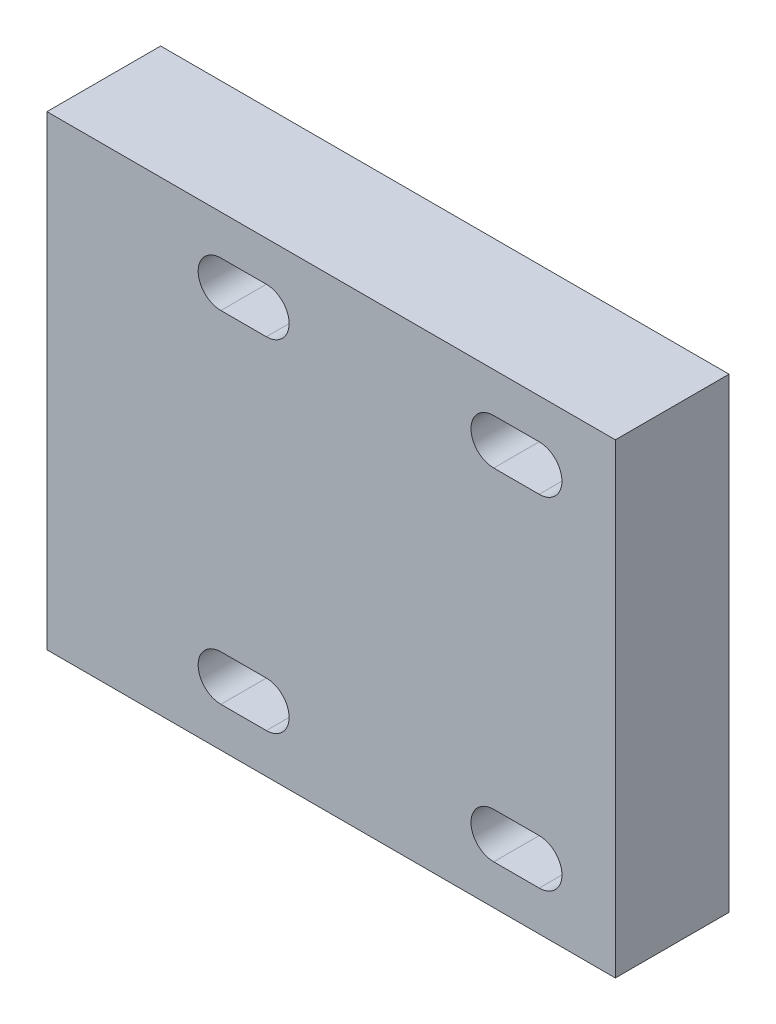
ISO-10303-21;
HEADER;
FILE_DESCRIPTION(('STEP AP214'),'2;1');
FILE_NAME('part.step','',(''),(''),'','','');
FILE_SCHEMA(('AUTOMOTIVE_DESIGN { 1 0 10303 214 1 1 1 1 }'));
ENDSEC;
DATA;
#1=APPLICATION_CONTEXT('core data for automotive mechanical design processes');
#2=APPLICATION_PROTOCOL_DEFINITION('international standard','automotive_design',2000,#1);
#3=PRODUCT_CONTEXT('',#1,'mechanical');
#4=PRODUCT('Part','Part','',(#3));
#5=PRODUCT_RELATED_PRODUCT_CATEGORY('part','',(#4));
#6=PRODUCT_DEFINITION_FORMATION('','',#4);
#7=PRODUCT_DEFINITION_CONTEXT('part definition',#1,'design');
#8=PRODUCT_DEFINITION('design','',#6,#7);
#9=PRODUCT_DEFINITION_SHAPE('','',#8);
#10=(LENGTH_UNIT() NAMED_UNIT(*) SI_UNIT(.MILLI.,.METRE.));
#11=(NAMED_UNIT(*) PLANE_ANGLE_UNIT() SI_UNIT($,.RADIAN.));
#12=(NAMED_UNIT(*) SI_UNIT($,.STERADIAN.) SOLID_ANGLE_UNIT());
#13=UNCERTAINTY_MEASURE_WITH_UNIT(LENGTH_MEASURE(1.E-05),#10,'distance_accuracy_value','');
#14=(GEOMETRIC_REPRESENTATION_CONTEXT(3) GLOBAL_UNCERTAINTY_ASSIGNED_CONTEXT((#13)) GLOBAL_UNIT_ASSIGNED_CONTEXT((#10,
#11,#12)) REPRESENTATION_CONTEXT('',''));
#15=CARTESIAN_POINT('',(0.,0.,0.));
#16=DIRECTION('',(0.,0.,1.));
#17=DIRECTION('',(1.,0.,0.));
#18=AXIS2_PLACEMENT_3D('',#15,#16,#17);
#19=CARTESIAN_POINT('',(-25.,-20.5,-10.));
#20=DIRECTION('',(1.,0.,0.));
#21=DIRECTION('',(0.,0.,1.));
#22=AXIS2_PLACEMENT_3D('',#19,#20,#21);
#23=PLANE('',#22);
#24=DIRECTION('',(0.,-1.,0.));
#25=VECTOR('',#24,1.);
#26=CARTESIAN_POINT('',(-25.,-20.5,0.));
#27=LINE('',#26,#25);
#28=CARTESIAN_POINT('',(-25.,20.5,0.));
#29=VERTEX_POINT('',#28);
#30=CARTESIAN_POINT('',(-25.,-20.5,0.));
#31=VERTEX_POINT('',#30);
#32=EDGE_CURVE('E301',#29,#31,#27,.T.);
#33=ORIENTED_EDGE('',*,*,#32,.F.);
#34=DIRECTION('',(0.,0.,1.));
#35=VECTOR('',#34,1.);
#36=CARTESIAN_POINT('',(-25.,20.5,-10.));
#37=LINE('',#36,#35);
#38=CARTESIAN_POINT('',(-25.,20.5,-10.));
#39=VERTEX_POINT('',#38);
#40=EDGE_CURVE('E319',#39,#29,#37,.T.);
#41=ORIENTED_EDGE('',*,*,#40,.F.);
#42=DIRECTION('',(0.,-1.,0.));
#43=VECTOR('',#42,1.);
#44=CARTESIAN_POINT('',(-25.,-20.5,-10.));
#45=LINE('',#44,#43);
#46=CARTESIAN_POINT('',(-25.,-20.5,-10.));
#47=VERTEX_POINT('',#46);
#48=EDGE_CURVE('E307',#39,#47,#45,.T.);
#49=ORIENTED_EDGE('',*,*,#48,.T.);
#50=DIRECTION('',(0.,0.,1.));
#51=VECTOR('',#50,1.);
#52=CARTESIAN_POINT('',(-25.,-20.5,-10.));
#53=LINE('',#52,#51);
#54=EDGE_CURVE('E11',#47,#31,#53,.T.);
#55=ORIENTED_EDGE('',*,*,#54,.T.);
#56=EDGE_LOOP('',(#33,#41,#49,#55));
#57=FACE_BOUND('',#56,.T.);
#58=ADVANCED_FACE('F35',(#57),#23,.F.);
#59=CARTESIAN_POINT('',(25.,-20.5,-10.));
#60=DIRECTION('',(0.,1.,0.));
#61=DIRECTION('',(-1.,0.,0.));
#62=AXIS2_PLACEMENT_3D('',#59,#60,#61);
#63=PLANE('',#62);
#64=DIRECTION('',(1.,0.,0.));
#65=VECTOR('',#64,1.);
#66=CARTESIAN_POINT('',(25.,-20.5,0.));
#67=LINE('',#66,#65);
#68=CARTESIAN_POINT('',(25.,-20.5,0.));
#69=VERTEX_POINT('',#68);
#70=EDGE_CURVE('E322',#31,#69,#67,.T.);
#71=ORIENTED_EDGE('',*,*,#70,.F.);
#72=ORIENTED_EDGE('',*,*,#54,.F.);
#73=DIRECTION('',(1.,0.,0.));
#74=VECTOR('',#73,1.);
#75=CARTESIAN_POINT('',(25.,-20.5,-10.));
#76=LINE('',#75,#74);
#77=CARTESIAN_POINT('',(25.,-20.5,-10.));
#78=VERTEX_POINT('',#77);
#79=EDGE_CURVE('E310',#47,#78,#76,.T.);
#80=ORIENTED_EDGE('',*,*,#79,.T.);
#81=DIRECTION('',(0.,0.,1.));
#82=VECTOR('',#81,1.);
#83=CARTESIAN_POINT('',(25.,-20.5,-10.));
#84=LINE('',#83,#82);
#85=EDGE_CURVE('E42',#78,#69,#84,.T.);
#86=ORIENTED_EDGE('',*,*,#85,.T.);
#87=EDGE_LOOP('',(#71,#72,#80,#86));
#88=FACE_BOUND('',#87,.T.);
#89=ADVANCED_FACE('F336',(#88),#63,.F.);
#90=CARTESIAN_POINT('',(25.,20.5,-10.));
#91=DIRECTION('',(-1.,0.,0.));
#92=DIRECTION('',(0.,-1.,0.));
#93=AXIS2_PLACEMENT_3D('',#90,#91,#92);
#94=PLANE('',#93);
#95=DIRECTION('',(0.,1.,0.));
#96=VECTOR('',#95,1.);
#97=CARTESIAN_POINT('',(25.,20.5,0.));
#98=LINE('',#97,#96);
#99=CARTESIAN_POINT('',(25.,20.5,0.));
#100=VERTEX_POINT('',#99);
#101=EDGE_CURVE('E325',#69,#100,#98,.T.);
#102=ORIENTED_EDGE('',*,*,#101,.F.);
#103=ORIENTED_EDGE('',*,*,#85,.F.);
#104=DIRECTION('',(0.,1.,0.));
#105=VECTOR('',#104,1.);
#106=CARTESIAN_POINT('',(25.,20.5,-10.));
#107=LINE('',#106,#105);
#108=CARTESIAN_POINT('',(25.,20.5,-10.));
#109=VERTEX_POINT('',#108);
#110=EDGE_CURVE('E314',#78,#109,#107,.T.);
#111=ORIENTED_EDGE('',*,*,#110,.T.);
#112=DIRECTION('',(0.,0.,1.));
#113=VECTOR('',#112,1.);
#114=CARTESIAN_POINT('',(25.,20.5,-10.));
#115=LINE('',#114,#113);
#116=EDGE_CURVE('E331',#109,#100,#115,.T.);
#117=ORIENTED_EDGE('',*,*,#116,.T.);
#118=EDGE_LOOP('',(#102,#103,#111,#117));
#119=FACE_BOUND('',#118,.T.);
#120=ADVANCED_FACE('F347',(#119),#94,.F.);
#121=CARTESIAN_POINT('',(-25.,20.5,-10.));
#122=DIRECTION('',(0.,-1.,0.));
#123=DIRECTION('',(0.,0.,1.));
#124=AXIS2_PLACEMENT_3D('',#121,#122,#123);
#125=PLANE('',#124);
#126=DIRECTION('',(-1.,0.,0.));
#127=VECTOR('',#126,1.);
#128=CARTESIAN_POINT('',(-25.,20.5,0.));
#129=LINE('',#128,#127);
#130=EDGE_CURVE('E311',#100,#29,#129,.T.);
#131=ORIENTED_EDGE('',*,*,#130,.F.);
#132=ORIENTED_EDGE('',*,*,#116,.F.);
#133=DIRECTION('',(-1.,0.,0.));
#134=VECTOR('',#133,1.);
#135=CARTESIAN_POINT('',(-25.,20.5,-10.));
#136=LINE('',#135,#134);
#137=EDGE_CURVE('E317',#109,#39,#136,.T.);
#138=ORIENTED_EDGE('',*,*,#137,.T.);
#139=ORIENTED_EDGE('',*,*,#40,.T.);
#140=EDGE_LOOP('',(#131,#132,#138,#139));
#141=FACE_BOUND('',#140,.T.);
#142=ADVANCED_FACE('F349',(#141),#125,.F.);
#143=CARTESIAN_POINT('',(0.,0.,-10.));
#144=DIRECTION('',(0.,0.,1.));
#145=DIRECTION('',(-1.,0.,0.));
#146=AXIS2_PLACEMENT_3D('',#143,#144,#145);
#147=PLANE('',#146);
#148=DIRECTION('',(-1.,0.,0.));
#149=VECTOR('',#148,1.);
#150=CARTESIAN_POINT('',(18.2999999999988,13.0000000000002,-10.));
#151=LINE('',#150,#149);
#152=CARTESIAN_POINT('',(18.2999999999988,13.0000000000002,-10.));
#153=VERTEX_POINT('',#152);
#154=CARTESIAN_POINT('',(14.2999999999987,13.0000000000002,-10.));
#155=VERTEX_POINT('',#154);
#156=EDGE_CURVE('E225',#153,#155,#151,.T.);
#157=ORIENTED_EDGE('',*,*,#156,.F.);
#158=CARTESIAN_POINT('',(18.2999999999988,15.0000000000002,-10.));
#159=DIRECTION('',(0.,0.,-1.));
#160=DIRECTION('',(-1.,0.,0.));
#161=AXIS2_PLACEMENT_3D('',#158,#159,#160);
#162=CIRCLE('',#161,2.00000000000001);
#163=CARTESIAN_POINT('',(18.2999999999988,17.0000000000002,-10.));
#164=VERTEX_POINT('',#163);
#165=EDGE_CURVE('E223',#164,#153,#162,.T.);
#166=ORIENTED_EDGE('',*,*,#165,.F.);
#167=DIRECTION('',(1.,0.,0.));
#168=VECTOR('',#167,1.);
#169=CARTESIAN_POINT('',(14.2999999999987,17.0000000000002,-10.));
#170=LINE('',#169,#168);
#171=CARTESIAN_POINT('',(14.2999999999987,17.0000000000002,-10.));
#172=VERTEX_POINT('',#171);
#173=EDGE_CURVE('E220',#172,#164,#170,.T.);
#174=ORIENTED_EDGE('',*,*,#173,.F.);
#175=CARTESIAN_POINT('',(14.2999999999987,15.0000000000002,-10.));
#176=DIRECTION('',(0.,0.,-1.));
#177=DIRECTION('',(-1.,0.,0.));
#178=AXIS2_PLACEMENT_3D('',#175,#176,#177);
#179=CIRCLE('',#178,2.00000000000001);
#180=EDGE_CURVE('E217',#155,#172,#179,.T.);
#181=ORIENTED_EDGE('',*,*,#180,.F.);
#182=EDGE_LOOP('',(#157,#166,#174,#181));
#183=FACE_BOUND('',#182,.T.);
#184=DIRECTION('',(1.,0.,0.));
#185=VECTOR('',#184,1.);
#186=CARTESIAN_POINT('',(-5.70000000000125,-13.0000000000002,-10.));
#187=LINE('',#186,#185);
#188=CARTESIAN_POINT('',(-9.70000000000126,-13.0000000000002,-10.));
#189=VERTEX_POINT('',#188);
#190=CARTESIAN_POINT('',(-5.70000000000125,-13.0000000000002,-10.));
#191=VERTEX_POINT('',#190);
#192=EDGE_CURVE('E256',#189,#191,#187,.T.);
#193=ORIENTED_EDGE('',*,*,#192,.F.);
#194=CARTESIAN_POINT('',(-9.70000000000126,-15.0000000000002,-10.));
#195=DIRECTION('',(0.,0.,-1.));
#196=DIRECTION('',(1.,0.,0.));
#197=AXIS2_PLACEMENT_3D('',#194,#195,#196);
#198=CIRCLE('',#197,2.00000000000001);
#199=CARTESIAN_POINT('',(-9.70000000000126,-17.0000000000002,-10.));
#200=VERTEX_POINT('',#199);
#201=EDGE_CURVE('E254',#200,#189,#198,.T.);
#202=ORIENTED_EDGE('',*,*,#201,.F.);
#203=DIRECTION('',(-1.,0.,0.));
#204=VECTOR('',#203,1.);
#205=CARTESIAN_POINT('',(-9.70000000000126,-17.0000000000002,-10.));
#206=LINE('',#205,#204);
#207=CARTESIAN_POINT('',(-5.70000000000125,-17.0000000000002,-10.));
#208=VERTEX_POINT('',#207);
#209=EDGE_CURVE('E251',#208,#200,#206,.T.);
#210=ORIENTED_EDGE('',*,*,#209,.F.);
#211=CARTESIAN_POINT('',(-5.70000000000125,-15.0000000000002,-10.));
#212=DIRECTION('',(0.,0.,-1.));
#213=DIRECTION('',(1.,0.,0.));
#214=AXIS2_PLACEMENT_3D('',#211,#212,#213);
#215=CIRCLE('',#214,2.);
#216=EDGE_CURVE('E248',#191,#208,#215,.T.);
#217=ORIENTED_EDGE('',*,*,#216,.F.);
#218=EDGE_LOOP('',(#193,#202,#210,#217));
#219=FACE_BOUND('',#218,.T.);
#220=DIRECTION('',(1.,0.,0.));
#221=VECTOR('',#220,1.);
#222=CARTESIAN_POINT('',(18.2999999999988,-13.0000000000002,-10.));
#223=LINE('',#222,#221);
#224=CARTESIAN_POINT('',(14.2999999999987,-13.0000000000002,-10.));
#225=VERTEX_POINT('',#224);
#226=CARTESIAN_POINT('',(18.2999999999988,-13.0000000000002,-10.));
#227=VERTEX_POINT('',#226);
#228=EDGE_CURVE('E185',#225,#227,#223,.T.);
#229=ORIENTED_EDGE('',*,*,#228,.F.);
#230=CARTESIAN_POINT('',(14.2999999999987,-15.0000000000002,-10.));
#231=DIRECTION('',(0.,0.,-1.));
#232=DIRECTION('',(1.,0.,0.));
#233=AXIS2_PLACEMENT_3D('',#230,#231,#232);
#234=CIRCLE('',#233,2.00000000000001);
#235=CARTESIAN_POINT('',(14.2999999999987,-17.0000000000002,-10.));
#236=VERTEX_POINT('',#235);
#237=EDGE_CURVE('E199',#236,#225,#234,.T.);
#238=ORIENTED_EDGE('',*,*,#237,.F.);
#239=DIRECTION('',(-1.,0.,0.));
#240=VECTOR('',#239,1.);
#241=CARTESIAN_POINT('',(14.2999999999987,-17.0000000000002,-10.));
#242=LINE('',#241,#240);
#243=CARTESIAN_POINT('',(18.2999999999988,-17.0000000000002,-10.));
#244=VERTEX_POINT('',#243);
#245=EDGE_CURVE('E177',#244,#236,#242,.T.);
#246=ORIENTED_EDGE('',*,*,#245,.F.);
#247=CARTESIAN_POINT('',(18.2999999999988,-15.0000000000002,-10.));
#248=DIRECTION('',(0.,0.,-1.));
#249=DIRECTION('',(1.,0.,0.));
#250=AXIS2_PLACEMENT_3D('',#247,#248,#249);
#251=CIRCLE('',#250,2.00000000000001);
#252=EDGE_CURVE('E188',#227,#244,#251,.T.);
#253=ORIENTED_EDGE('',*,*,#252,.F.);
#254=EDGE_LOOP('',(#229,#238,#246,#253));
#255=FACE_BOUND('',#254,.T.);
#256=DIRECTION('',(1.,0.,0.));
#257=VECTOR('',#256,1.);
#258=CARTESIAN_POINT('',(-9.70000000000126,17.0000000000002,-10.));
#259=LINE('',#258,#257);
#260=CARTESIAN_POINT('',(-9.70000000000126,17.0000000000002,-10.));
#261=VERTEX_POINT('',#260);
#262=CARTESIAN_POINT('',(-5.70000000000125,17.0000000000002,-10.));
#263=VERTEX_POINT('',#262);
#264=EDGE_CURVE('E285',#261,#263,#259,.T.);
#265=ORIENTED_EDGE('',*,*,#264,.F.);
#266=CARTESIAN_POINT('',(-9.70000000000126,15.0000000000002,-10.));
#267=DIRECTION('',(0.,0.,-1.));
#268=DIRECTION('',(-1.,0.,0.));
#269=AXIS2_PLACEMENT_3D('',#266,#267,#268);
#270=CIRCLE('',#269,2.00000000000001);
#271=CARTESIAN_POINT('',(-9.70000000000126,13.0000000000002,-10.));
#272=VERTEX_POINT('',#271);
#273=EDGE_CURVE('E282',#272,#261,#270,.T.);
#274=ORIENTED_EDGE('',*,*,#273,.F.);
#275=DIRECTION('',(-1.,0.,0.));
#276=VECTOR('',#275,1.);
#277=CARTESIAN_POINT('',(-5.70000000000125,13.0000000000002,-10.));
#278=LINE('',#277,#276);
#279=CARTESIAN_POINT('',(-5.70000000000125,13.0000000000002,-10.));
#280=VERTEX_POINT('',#279);
#281=EDGE_CURVE('E278',#280,#272,#278,.T.);
#282=ORIENTED_EDGE('',*,*,#281,.F.);
#283=CARTESIAN_POINT('',(-5.70000000000125,15.0000000000002,-10.));
#284=DIRECTION('',(0.,0.,-1.));
#285=DIRECTION('',(-1.,0.,0.));
#286=AXIS2_PLACEMENT_3D('',#283,#284,#285);
#287=CIRCLE('',#286,2.);
#288=EDGE_CURVE('E275',#263,#280,#287,.T.);
#289=ORIENTED_EDGE('',*,*,#288,.F.);
#290=EDGE_LOOP('',(#265,#274,#282,#289));
#291=FACE_BOUND('',#290,.T.);
#292=ORIENTED_EDGE('',*,*,#48,.F.);
#293=ORIENTED_EDGE('',*,*,#137,.F.);
#294=ORIENTED_EDGE('',*,*,#110,.F.);
#295=ORIENTED_EDGE('',*,*,#79,.F.);
#296=EDGE_LOOP('',(#292,#293,#294,#295));
#297=FACE_BOUND('',#296,.T.);
#298=ADVANCED_FACE('F196',(#183,#219,#255,#291,#297),#147,.F.);
#299=CARTESIAN_POINT('',(0.,0.,0.));
#300=DIRECTION('',(0.,0.,1.));
#301=DIRECTION('',(-1.,0.,0.));
#302=AXIS2_PLACEMENT_3D('',#299,#300,#301);
#303=PLANE('',#302);
#304=CARTESIAN_POINT('',(14.2999999999987,15.0000000000002,0.));
#305=DIRECTION('',(0.,0.,-1.));
#306=DIRECTION('',(-1.,0.,0.));
#307=AXIS2_PLACEMENT_3D('',#304,#305,#306);
#308=CIRCLE('',#307,2.00000000000001);
#309=CARTESIAN_POINT('',(14.2999999999987,13.0000000000002,0.));
#310=VERTEX_POINT('',#309);
#311=CARTESIAN_POINT('',(14.2999999999987,17.0000000000002,0.));
#312=VERTEX_POINT('',#311);
#313=EDGE_CURVE('E229',#310,#312,#308,.T.);
#314=ORIENTED_EDGE('',*,*,#313,.T.);
#315=DIRECTION('',(1.,0.,0.));
#316=VECTOR('',#315,1.);
#317=CARTESIAN_POINT('',(14.2999999999987,17.0000000000002,0.));
#318=LINE('',#317,#316);
#319=CARTESIAN_POINT('',(18.2999999999988,17.0000000000002,0.));
#320=VERTEX_POINT('',#319);
#321=EDGE_CURVE('E232',#312,#320,#318,.T.);
#322=ORIENTED_EDGE('',*,*,#321,.T.);
#323=CARTESIAN_POINT('',(18.2999999999988,15.0000000000002,0.));
#324=DIRECTION('',(0.,0.,-1.));
#325=DIRECTION('',(-1.,0.,0.));
#326=AXIS2_PLACEMENT_3D('',#323,#324,#325);
#327=CIRCLE('',#326,2.00000000000001);
#328=CARTESIAN_POINT('',(18.2999999999988,13.0000000000002,0.));
#329=VERTEX_POINT('',#328);
#330=EDGE_CURVE('E236',#320,#329,#327,.T.);
#331=ORIENTED_EDGE('',*,*,#330,.T.);
#332=DIRECTION('',(-1.,0.,0.));
#333=VECTOR('',#332,1.);
#334=CARTESIAN_POINT('',(18.2999999999988,13.0000000000002,0.));
#335=LINE('',#334,#333);
#336=EDGE_CURVE('E221',#329,#310,#335,.T.);
#337=ORIENTED_EDGE('',*,*,#336,.T.);
#338=EDGE_LOOP('',(#314,#322,#331,#337));
#339=FACE_BOUND('',#338,.T.);
#340=CARTESIAN_POINT('',(-5.70000000000125,-15.0000000000002,0.));
#341=DIRECTION('',(0.,0.,-1.));
#342=DIRECTION('',(1.,0.,0.));
#343=AXIS2_PLACEMENT_3D('',#340,#341,#342);
#344=CIRCLE('',#343,2.);
#345=CARTESIAN_POINT('',(-5.70000000000125,-13.0000000000002,0.));
#346=VERTEX_POINT('',#345);
#347=CARTESIAN_POINT('',(-5.70000000000125,-17.0000000000002,0.));
#348=VERTEX_POINT('',#347);
#349=EDGE_CURVE('E213',#346,#348,#344,.T.);
#350=ORIENTED_EDGE('',*,*,#349,.T.);
#351=DIRECTION('',(-1.,0.,0.));
#352=VECTOR('',#351,1.);
#353=CARTESIAN_POINT('',(-9.70000000000126,-17.0000000000002,0.));
#354=LINE('',#353,#352);
#355=CARTESIAN_POINT('',(-9.70000000000126,-17.0000000000002,0.));
#356=VERTEX_POINT('',#355);
#357=EDGE_CURVE('E262',#348,#356,#354,.T.);
#358=ORIENTED_EDGE('',*,*,#357,.T.);
#359=CARTESIAN_POINT('',(-9.70000000000126,-15.0000000000002,0.));
#360=DIRECTION('',(0.,0.,-1.));
#361=DIRECTION('',(1.,0.,0.));
#362=AXIS2_PLACEMENT_3D('',#359,#360,#361);
#363=CIRCLE('',#362,2.00000000000001);
#364=CARTESIAN_POINT('',(-9.70000000000126,-13.0000000000002,0.));
#365=VERTEX_POINT('',#364);
#366=EDGE_CURVE('E265',#356,#365,#363,.T.);
#367=ORIENTED_EDGE('',*,*,#366,.T.);
#368=DIRECTION('',(1.,0.,0.));
#369=VECTOR('',#368,1.);
#370=CARTESIAN_POINT('',(-5.70000000000125,-13.0000000000002,0.));
#371=LINE('',#370,#369);
#372=EDGE_CURVE('E252',#365,#346,#371,.T.);
#373=ORIENTED_EDGE('',*,*,#372,.T.);
#374=EDGE_LOOP('',(#350,#358,#367,#373));
#375=FACE_BOUND('',#374,.T.);
#376=CARTESIAN_POINT('',(18.2999999999988,-15.0000000000002,0.));
#377=DIRECTION('',(0.,0.,-1.));
#378=DIRECTION('',(1.,0.,0.));
#379=AXIS2_PLACEMENT_3D('',#376,#377,#378);
#380=CIRCLE('',#379,2.00000000000001);
#381=CARTESIAN_POINT('',(18.2999999999988,-13.0000000000002,0.));
#382=VERTEX_POINT('',#381);
#383=CARTESIAN_POINT('',(18.2999999999988,-17.0000000000002,0.));
#384=VERTEX_POINT('',#383);
#385=EDGE_CURVE('E204',#382,#384,#380,.T.);
#386=ORIENTED_EDGE('',*,*,#385,.T.);
#387=DIRECTION('',(-1.,0.,0.));
#388=VECTOR('',#387,1.);
#389=CARTESIAN_POINT('',(14.2999999999987,-17.0000000000002,0.));
#390=LINE('',#389,#388);
#391=CARTESIAN_POINT('',(14.2999999999987,-17.0000000000002,0.));
#392=VERTEX_POINT('',#391);
#393=EDGE_CURVE('E180',#384,#392,#390,.T.);
#394=ORIENTED_EDGE('',*,*,#393,.T.);
#395=CARTESIAN_POINT('',(14.2999999999987,-15.0000000000002,0.));
#396=DIRECTION('',(0.,0.,-1.));
#397=DIRECTION('',(1.,0.,0.));
#398=AXIS2_PLACEMENT_3D('',#395,#396,#397);
#399=CIRCLE('',#398,2.00000000000001);
#400=CARTESIAN_POINT('',(14.2999999999987,-13.0000000000002,0.));
#401=VERTEX_POINT('',#400);
#402=EDGE_CURVE('E207',#392,#401,#399,.T.);
#403=ORIENTED_EDGE('',*,*,#402,.T.);
#404=DIRECTION('',(1.,0.,0.));
#405=VECTOR('',#404,1.);
#406=CARTESIAN_POINT('',(18.2999999999988,-13.0000000000002,0.));
#407=LINE('',#406,#405);
#408=EDGE_CURVE('E194',#401,#382,#407,.T.);
#409=ORIENTED_EDGE('',*,*,#408,.T.);
#410=EDGE_LOOP('',(#386,#394,#403,#409));
#411=FACE_BOUND('',#410,.T.);
#412=CARTESIAN_POINT('',(-5.70000000000125,15.0000000000002,0.));
#413=DIRECTION('',(0.,0.,-1.));
#414=DIRECTION('',(-1.,0.,0.));
#415=AXIS2_PLACEMENT_3D('',#412,#413,#414);
#416=CIRCLE('',#415,2.);
#417=CARTESIAN_POINT('',(-5.70000000000125,17.0000000000002,0.));
#418=VERTEX_POINT('',#417);
#419=CARTESIAN_POINT('',(-5.70000000000125,13.0000000000002,0.));
#420=VERTEX_POINT('',#419);
#421=EDGE_CURVE('E243',#418,#420,#416,.T.);
#422=ORIENTED_EDGE('',*,*,#421,.T.);
#423=DIRECTION('',(-1.,0.,0.));
#424=VECTOR('',#423,1.);
#425=CARTESIAN_POINT('',(-5.70000000000125,13.0000000000002,0.));
#426=LINE('',#425,#424);
#427=CARTESIAN_POINT('',(-9.70000000000126,13.0000000000002,0.));
#428=VERTEX_POINT('',#427);
#429=EDGE_CURVE('E291',#420,#428,#426,.T.);
#430=ORIENTED_EDGE('',*,*,#429,.T.);
#431=CARTESIAN_POINT('',(-9.70000000000126,15.0000000000002,0.));
#432=DIRECTION('',(0.,0.,-1.));
#433=DIRECTION('',(-1.,0.,0.));
#434=AXIS2_PLACEMENT_3D('',#431,#432,#433);
#435=CIRCLE('',#434,2.00000000000001);
#436=CARTESIAN_POINT('',(-9.70000000000126,17.0000000000002,0.));
#437=VERTEX_POINT('',#436);
#438=EDGE_CURVE('E294',#428,#437,#435,.T.);
#439=ORIENTED_EDGE('',*,*,#438,.T.);
#440=DIRECTION('',(1.,0.,0.));
#441=VECTOR('',#440,1.);
#442=CARTESIAN_POINT('',(-9.70000000000126,17.0000000000002,0.));
#443=LINE('',#442,#441);
#444=EDGE_CURVE('E279',#437,#418,#443,.T.);
#445=ORIENTED_EDGE('',*,*,#444,.T.);
#446=EDGE_LOOP('',(#422,#430,#439,#445));
#447=FACE_BOUND('',#446,.T.);
#448=ORIENTED_EDGE('',*,*,#32,.T.);
#449=ORIENTED_EDGE('',*,*,#70,.T.);
#450=ORIENTED_EDGE('',*,*,#101,.T.);
#451=ORIENTED_EDGE('',*,*,#130,.T.);
#452=EDGE_LOOP('',(#448,#449,#450,#451));
#453=FACE_BOUND('',#452,.T.);
#454=ADVANCED_FACE('F340',(#339,#375,#411,#447,#453),#303,.T.);
#455=CARTESIAN_POINT('',(-5.70000000000125,15.0000000000002,-10.));
#456=DIRECTION('',(0.,0.,1.));
#457=DIRECTION('',(-1.,0.,0.));
#458=AXIS2_PLACEMENT_3D('',#455,#456,#457);
#459=CYLINDRICAL_SURFACE('',#458,2.);
#460=ORIENTED_EDGE('',*,*,#421,.F.);
#461=DIRECTION('',(0.,0.,1.));
#462=VECTOR('',#461,1.);
#463=CARTESIAN_POINT('',(-5.70000000000125,17.0000000000002,-10.));
#464=LINE('',#463,#462);
#465=EDGE_CURVE('E299',#263,#418,#464,.T.);
#466=ORIENTED_EDGE('',*,*,#465,.F.);
#467=ORIENTED_EDGE('',*,*,#288,.T.);
#468=DIRECTION('',(0.,0.,1.));
#469=VECTOR('',#468,1.);
#470=CARTESIAN_POINT('',(-5.70000000000125,13.0000000000002,-10.));
#471=LINE('',#470,#469);
#472=EDGE_CURVE('E288',#280,#420,#471,.T.);
#473=ORIENTED_EDGE('',*,*,#472,.T.);
#474=EDGE_LOOP('',(#460,#466,#467,#473));
#475=FACE_BOUND('',#474,.T.);
#476=ADVANCED_FACE('F389',(#475),#459,.F.);
#477=CARTESIAN_POINT('',(-9.70000000000126,17.0000000000002,-10.));
#478=DIRECTION('',(0.,1.,0.));
#479=DIRECTION('',(0.,0.,-1.));
#480=AXIS2_PLACEMENT_3D('',#477,#478,#479);
#481=PLANE('',#480);
#482=ORIENTED_EDGE('',*,*,#444,.F.);
#483=DIRECTION('',(0.,0.,1.));
#484=VECTOR('',#483,1.);
#485=CARTESIAN_POINT('',(-9.70000000000126,17.0000000000002,-10.));
#486=LINE('',#485,#484);
#487=EDGE_CURVE('E302',#261,#437,#486,.T.);
#488=ORIENTED_EDGE('',*,*,#487,.F.);
#489=ORIENTED_EDGE('',*,*,#264,.T.);
#490=ORIENTED_EDGE('',*,*,#465,.T.);
#491=EDGE_LOOP('',(#482,#488,#489,#490));
#492=FACE_BOUND('',#491,.T.);
#493=ADVANCED_FACE('F398',(#492),#481,.F.);
#494=CARTESIAN_POINT('',(-9.70000000000126,15.0000000000002,-10.));
#495=DIRECTION('',(0.,0.,1.));
#496=DIRECTION('',(-1.,0.,0.));
#497=AXIS2_PLACEMENT_3D('',#494,#495,#496);
#498=CYLINDRICAL_SURFACE('',#497,2.00000000000001);
#499=ORIENTED_EDGE('',*,*,#438,.F.);
#500=DIRECTION('',(0.,0.,1.));
#501=VECTOR('',#500,1.);
#502=CARTESIAN_POINT('',(-9.70000000000126,13.0000000000002,-10.));
#503=LINE('',#502,#501);
#504=EDGE_CURVE('E304',#272,#428,#503,.T.);
#505=ORIENTED_EDGE('',*,*,#504,.F.);
#506=ORIENTED_EDGE('',*,*,#273,.T.);
#507=ORIENTED_EDGE('',*,*,#487,.T.);
#508=EDGE_LOOP('',(#499,#505,#506,#507));
#509=FACE_BOUND('',#508,.T.);
#510=ADVANCED_FACE('F408',(#509),#498,.F.);
#511=CARTESIAN_POINT('',(-5.70000000000125,13.0000000000002,-10.));
#512=DIRECTION('',(0.,-1.,0.));
#513=DIRECTION('',(1.,0.,0.));
#514=AXIS2_PLACEMENT_3D('',#511,#512,#513);
#515=PLANE('',#514);
#516=ORIENTED_EDGE('',*,*,#429,.F.);
#517=ORIENTED_EDGE('',*,*,#472,.F.);
#518=ORIENTED_EDGE('',*,*,#281,.T.);
#519=ORIENTED_EDGE('',*,*,#504,.T.);
#520=EDGE_LOOP('',(#516,#517,#518,#519));
#521=FACE_BOUND('',#520,.T.);
#522=ADVANCED_FACE('F418',(#521),#515,.F.);
#523=CARTESIAN_POINT('',(18.2999999999988,-15.0000000000002,-10.));
#524=DIRECTION('',(0.,0.,1.));
#525=DIRECTION('',(-1.,0.,0.));
#526=AXIS2_PLACEMENT_3D('',#523,#524,#525);
#527=CYLINDRICAL_SURFACE('',#526,2.00000000000001);
#528=ORIENTED_EDGE('',*,*,#385,.F.);
#529=DIRECTION('',(0.,0.,1.));
#530=VECTOR('',#529,1.);
#531=CARTESIAN_POINT('',(18.2999999999988,-13.0000000000002,-10.));
#532=LINE('',#531,#530);
#533=EDGE_CURVE('E190',#227,#382,#532,.T.);
#534=ORIENTED_EDGE('',*,*,#533,.F.);
#535=ORIENTED_EDGE('',*,*,#252,.T.);
#536=DIRECTION('',(0.,0.,1.));
#537=VECTOR('',#536,1.);
#538=CARTESIAN_POINT('',(18.2999999999988,-17.0000000000002,-10.));
#539=LINE('',#538,#537);
#540=EDGE_CURVE('E173',#244,#384,#539,.T.);
#541=ORIENTED_EDGE('',*,*,#540,.T.);
#542=EDGE_LOOP('',(#528,#534,#535,#541));
#543=FACE_BOUND('',#542,.T.);
#544=ADVANCED_FACE('F189',(#543),#527,.F.);
#545=CARTESIAN_POINT('',(18.2999999999988,-13.0000000000002,-10.));
#546=DIRECTION('',(0.,1.,0.));
#547=DIRECTION('',(0.,0.,-1.));
#548=AXIS2_PLACEMENT_3D('',#545,#546,#547);
#549=PLANE('',#548);
#550=ORIENTED_EDGE('',*,*,#408,.F.);
#551=DIRECTION('',(0.,0.,1.));
#552=VECTOR('',#551,1.);
#553=CARTESIAN_POINT('',(14.2999999999987,-13.0000000000002,-10.));
#554=LINE('',#553,#552);
#555=EDGE_CURVE('E214',#225,#401,#554,.T.);
#556=ORIENTED_EDGE('',*,*,#555,.F.);
#557=ORIENTED_EDGE('',*,*,#228,.T.);
#558=ORIENTED_EDGE('',*,*,#533,.T.);
#559=EDGE_LOOP('',(#550,#556,#557,#558));
#560=FACE_BOUND('',#559,.T.);
#561=ADVANCED_FACE('F437',(#560),#549,.F.);
#562=CARTESIAN_POINT('',(14.2999999999987,-15.0000000000002,-10.));
#563=DIRECTION('',(0.,0.,1.));
#564=DIRECTION('',(-1.,0.,0.));
#565=AXIS2_PLACEMENT_3D('',#562,#563,#564);
#566=CYLINDRICAL_SURFACE('',#565,2.00000000000001);
#567=ORIENTED_EDGE('',*,*,#402,.F.);
#568=DIRECTION('',(0.,0.,1.));
#569=VECTOR('',#568,1.);
#570=CARTESIAN_POINT('',(14.2999999999987,-17.0000000000002,-10.));
#571=LINE('',#570,#569);
#572=EDGE_CURVE('E184',#236,#392,#571,.T.);
#573=ORIENTED_EDGE('',*,*,#572,.F.);
#574=ORIENTED_EDGE('',*,*,#237,.T.);
#575=ORIENTED_EDGE('',*,*,#555,.T.);
#576=EDGE_LOOP('',(#567,#573,#574,#575));
#577=FACE_BOUND('',#576,.T.);
#578=ADVANCED_FACE('F446',(#577),#566,.F.);
#579=CARTESIAN_POINT('',(14.2999999999987,-17.0000000000002,-10.));
#580=DIRECTION('',(0.,-1.,0.));
#581=DIRECTION('',(0.,0.,1.));
#582=AXIS2_PLACEMENT_3D('',#579,#580,#581);
#583=PLANE('',#582);
#584=ORIENTED_EDGE('',*,*,#393,.F.);
#585=ORIENTED_EDGE('',*,*,#540,.F.);
#586=ORIENTED_EDGE('',*,*,#245,.T.);
#587=ORIENTED_EDGE('',*,*,#572,.T.);
#588=EDGE_LOOP('',(#584,#585,#586,#587));
#589=FACE_BOUND('',#588,.T.);
#590=ADVANCED_FACE('F175',(#589),#583,.F.);
#591=CARTESIAN_POINT('',(-5.70000000000125,-15.0000000000002,-10.));
#592=DIRECTION('',(0.,0.,1.));
#593=DIRECTION('',(-1.,0.,0.));
#594=AXIS2_PLACEMENT_3D('',#591,#592,#593);
#595=CYLINDRICAL_SURFACE('',#594,2.);
#596=ORIENTED_EDGE('',*,*,#349,.F.);
#597=DIRECTION('',(0.,0.,1.));
#598=VECTOR('',#597,1.);
#599=CARTESIAN_POINT('',(-5.70000000000125,-13.0000000000002,-10.));
#600=LINE('',#599,#598);
#601=EDGE_CURVE('E233',#191,#346,#600,.T.);
#602=ORIENTED_EDGE('',*,*,#601,.F.);
#603=ORIENTED_EDGE('',*,*,#216,.T.);
#604=DIRECTION('',(0.,0.,1.));
#605=VECTOR('',#604,1.);
#606=CARTESIAN_POINT('',(-5.70000000000125,-17.0000000000002,-10.));
#607=LINE('',#606,#605);
#608=EDGE_CURVE('E259',#208,#348,#607,.T.);
#609=ORIENTED_EDGE('',*,*,#608,.T.);
#610=EDGE_LOOP('',(#596,#602,#603,#609));
#611=FACE_BOUND('',#610,.T.);
#612=ADVANCED_FACE('F465',(#611),#595,.F.);
#613=CARTESIAN_POINT('',(-5.70000000000125,-13.0000000000002,-10.));
#614=DIRECTION('',(0.,1.,0.));
#615=DIRECTION('',(-1.,0.,0.));
#616=AXIS2_PLACEMENT_3D('',#613,#614,#615);
#617=PLANE('',#616);
#618=ORIENTED_EDGE('',*,*,#372,.F.);
#619=DIRECTION('',(0.,0.,1.));
#620=VECTOR('',#619,1.);
#621=CARTESIAN_POINT('',(-9.70000000000126,-13.0000000000002,-10.));
#622=LINE('',#621,#620);
#623=EDGE_CURVE('E271',#189,#365,#622,.T.);
#624=ORIENTED_EDGE('',*,*,#623,.F.);
#625=ORIENTED_EDGE('',*,*,#192,.T.);
#626=ORIENTED_EDGE('',*,*,#601,.T.);
#627=EDGE_LOOP('',(#618,#624,#625,#626));
#628=FACE_BOUND('',#627,.T.);
#629=ADVANCED_FACE('F474',(#628),#617,.F.);
#630=CARTESIAN_POINT('',(-9.70000000000126,-15.0000000000002,-10.));
#631=DIRECTION('',(0.,0.,1.));
#632=DIRECTION('',(-1.,0.,0.));
#633=AXIS2_PLACEMENT_3D('',#630,#631,#632);
#634=CYLINDRICAL_SURFACE('',#633,2.00000000000001);
#635=ORIENTED_EDGE('',*,*,#366,.F.);
#636=DIRECTION('',(0.,0.,1.));
#637=VECTOR('',#636,1.);
#638=CARTESIAN_POINT('',(-9.70000000000126,-17.0000000000002,-10.));
#639=LINE('',#638,#637);
#640=EDGE_CURVE('E57',#200,#356,#639,.T.);
#641=ORIENTED_EDGE('',*,*,#640,.F.);
#642=ORIENTED_EDGE('',*,*,#201,.T.);
#643=ORIENTED_EDGE('',*,*,#623,.T.);
#644=EDGE_LOOP('',(#635,#641,#642,#643));
#645=FACE_BOUND('',#644,.T.);
#646=ADVANCED_FACE('F484',(#645),#634,.F.);
#647=CARTESIAN_POINT('',(-9.70000000000126,-17.0000000000002,-10.));
#648=DIRECTION('',(0.,-1.,0.));
#649=DIRECTION('',(0.,0.,1.));
#650=AXIS2_PLACEMENT_3D('',#647,#648,#649);
#651=PLANE('',#650);
#652=ORIENTED_EDGE('',*,*,#357,.F.);
#653=ORIENTED_EDGE('',*,*,#608,.F.);
#654=ORIENTED_EDGE('',*,*,#209,.T.);
#655=ORIENTED_EDGE('',*,*,#640,.T.);
#656=EDGE_LOOP('',(#652,#653,#654,#655));
#657=FACE_BOUND('',#656,.T.);
#658=ADVANCED_FACE('F494',(#657),#651,.F.);
#659=CARTESIAN_POINT('',(14.2999999999987,15.0000000000002,-10.));
#660=DIRECTION('',(0.,0.,1.));
#661=DIRECTION('',(-1.,0.,0.));
#662=AXIS2_PLACEMENT_3D('',#659,#660,#661);
#663=CYLINDRICAL_SURFACE('',#662,2.00000000000001);
#664=ORIENTED_EDGE('',*,*,#313,.F.);
#665=DIRECTION('',(0.,0.,1.));
#666=VECTOR('',#665,1.);
#667=CARTESIAN_POINT('',(14.2999999999987,13.0000000000002,-10.));
#668=LINE('',#667,#666);
#669=EDGE_CURVE('E241',#155,#310,#668,.T.);
#670=ORIENTED_EDGE('',*,*,#669,.F.);
#671=ORIENTED_EDGE('',*,*,#180,.T.);
#672=DIRECTION('',(0.,0.,1.));
#673=VECTOR('',#672,1.);
#674=CARTESIAN_POINT('',(14.2999999999987,17.0000000000002,-10.));
#675=LINE('',#674,#673);
#676=EDGE_CURVE('E228',#172,#312,#675,.T.);
#677=ORIENTED_EDGE('',*,*,#676,.T.);
#678=EDGE_LOOP('',(#664,#670,#671,#677));
#679=FACE_BOUND('',#678,.T.);
#680=ADVANCED_FACE('F503',(#679),#663,.F.);
#681=CARTESIAN_POINT('',(18.2999999999988,13.0000000000002,-10.));
#682=DIRECTION('',(0.,-1.,0.));
#683=DIRECTION('',(0.,0.,1.));
#684=AXIS2_PLACEMENT_3D('',#681,#682,#683);
#685=PLANE('',#684);
#686=ORIENTED_EDGE('',*,*,#336,.F.);
#687=DIRECTION('',(0.,0.,1.));
#688=VECTOR('',#687,1.);
#689=CARTESIAN_POINT('',(18.2999999999988,13.0000000000002,-10.));
#690=LINE('',#689,#688);
#691=EDGE_CURVE('E244',#153,#329,#690,.T.);
#692=ORIENTED_EDGE('',*,*,#691,.F.);
#693=ORIENTED_EDGE('',*,*,#156,.T.);
#694=ORIENTED_EDGE('',*,*,#669,.T.);
#695=EDGE_LOOP('',(#686,#692,#693,#694));
#696=FACE_BOUND('',#695,.T.);
#697=ADVANCED_FACE('F513',(#696),#685,.F.);
#698=CARTESIAN_POINT('',(18.2999999999988,15.0000000000002,-10.));
#699=DIRECTION('',(0.,0.,1.));
#700=DIRECTION('',(-1.,0.,0.));
#701=AXIS2_PLACEMENT_3D('',#698,#699,#700);
#702=CYLINDRICAL_SURFACE('',#701,2.00000000000001);
#703=ORIENTED_EDGE('',*,*,#330,.F.);
#704=DIRECTION('',(0.,0.,1.));
#705=VECTOR('',#704,1.);
#706=CARTESIAN_POINT('',(18.2999999999988,17.0000000000002,-10.));
#707=LINE('',#706,#705);
#708=EDGE_CURVE('E49',#164,#320,#707,.T.);
#709=ORIENTED_EDGE('',*,*,#708,.F.);
#710=ORIENTED_EDGE('',*,*,#165,.T.);
#711=ORIENTED_EDGE('',*,*,#691,.T.);
#712=EDGE_LOOP('',(#703,#709,#710,#711));
#713=FACE_BOUND('',#712,.T.);
#714=ADVANCED_FACE('F523',(#713),#702,.F.);
#715=CARTESIAN_POINT('',(14.2999999999987,17.0000000000002,-10.));
#716=DIRECTION('',(0.,1.,0.));
#717=DIRECTION('',(0.,0.,-1.));
#718=AXIS2_PLACEMENT_3D('',#715,#716,#717);
#719=PLANE('',#718);
#720=ORIENTED_EDGE('',*,*,#321,.F.);
#721=ORIENTED_EDGE('',*,*,#676,.F.);
#722=ORIENTED_EDGE('',*,*,#173,.T.);
#723=ORIENTED_EDGE('',*,*,#708,.T.);
#724=EDGE_LOOP('',(#720,#721,#722,#723));
#725=FACE_BOUND('',#724,.T.);
#726=ADVANCED_FACE('F533',(#725),#719,.F.);
#727=CLOSED_SHELL('',(#58,#89,#120,#142,#298,#454,#476,#493,#510,#522,#544,#561,#578,#590,#612,
#629,#646,#658,#680,#697,#714,#726));
#728=MANIFOLD_SOLID_BREP('B2',#727);
#729=ADVANCED_BREP_SHAPE_REPRESENTATION('',(#18,#728),#14);
#730=SHAPE_DEFINITION_REPRESENTATION(#9,#729);
ENDSEC;
END-ISO-10303-21;
